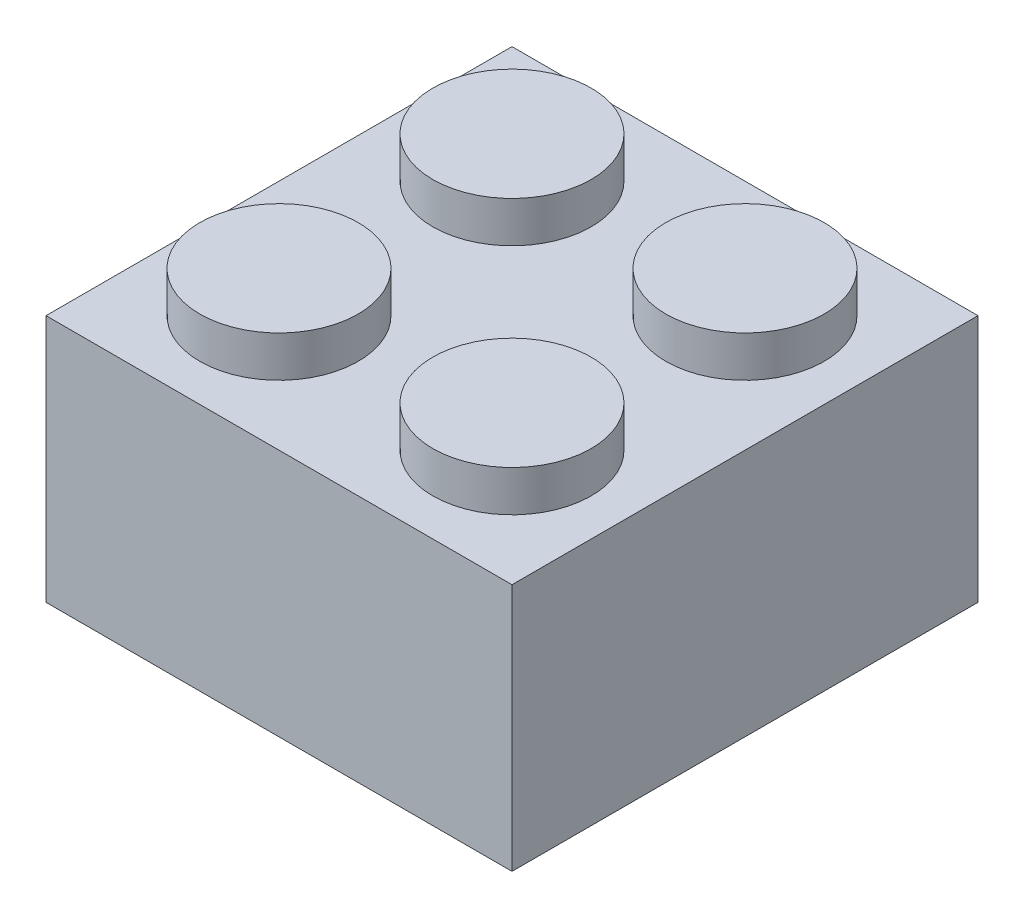
ISO-10303-21;
HEADER;
FILE_DESCRIPTION(('STEP AP214'),'2;1');
FILE_NAME('part.step','',(''),(''),'','','');
FILE_SCHEMA(('AUTOMOTIVE_DESIGN { 1 0 10303 214 1 1 1 1 }'));
ENDSEC;
DATA;
#1=APPLICATION_CONTEXT('core data for automotive mechanical design processes');
#2=APPLICATION_PROTOCOL_DEFINITION('international standard','automotive_design',2000,#1);
#3=PRODUCT_CONTEXT('',#1,'mechanical');
#4=PRODUCT('Part','Part','',(#3));
#5=PRODUCT_RELATED_PRODUCT_CATEGORY('part','',(#4));
#6=PRODUCT_DEFINITION_FORMATION('','',#4);
#7=PRODUCT_DEFINITION_CONTEXT('part definition',#1,'design');
#8=PRODUCT_DEFINITION('design','',#6,#7);
#9=PRODUCT_DEFINITION_SHAPE('','',#8);
#10=(LENGTH_UNIT() NAMED_UNIT(*) SI_UNIT(.MILLI.,.METRE.));
#11=(NAMED_UNIT(*) PLANE_ANGLE_UNIT() SI_UNIT($,.RADIAN.));
#12=(NAMED_UNIT(*) SI_UNIT($,.STERADIAN.) SOLID_ANGLE_UNIT());
#13=UNCERTAINTY_MEASURE_WITH_UNIT(LENGTH_MEASURE(1.E-05),#10,'distance_accuracy_value','');
#14=(GEOMETRIC_REPRESENTATION_CONTEXT(3) GLOBAL_UNCERTAINTY_ASSIGNED_CONTEXT((#13)) GLOBAL_UNIT_ASSIGNED_CONTEXT((#10,
#11,#12)) REPRESENTATION_CONTEXT('',''));
#15=CARTESIAN_POINT('',(0.,0.,0.));
#16=DIRECTION('',(0.,0.,1.));
#17=DIRECTION('',(1.,0.,0.));
#18=AXIS2_PLACEMENT_3D('',#15,#16,#17);
#19=CARTESIAN_POINT('',(7.93750000000001,4.2291,7.93749999999999));
#20=DIRECTION('',(0.,1.,0.));
#21=DIRECTION('',(0.,0.,1.));
#22=AXIS2_PLACEMENT_3D('',#19,#20,#21);
#23=PLANE('',#22);
#24=CARTESIAN_POINT('',(3.96875000000001,4.2291,3.96875));
#25=DIRECTION('',(0.,1.,0.));
#26=DIRECTION('',(0.,0.,1.));
#27=AXIS2_PLACEMENT_3D('',#24,#25,#26);
#28=CIRCLE('',#27,2.69875);
#29=CARTESIAN_POINT('',(3.96875000000001,4.2291,6.6675));
#30=VERTEX_POINT('',#29);
#31=EDGE_CURVE('E439',#30,#30,#28,.T.);
#32=ORIENTED_EDGE('',*,*,#31,.F.);
#33=EDGE_LOOP('',(#32));
#34=FACE_BOUND('',#33,.T.);
#35=DIRECTION('',(0.,0.,-1.));
#36=VECTOR('',#35,1.);
#37=CARTESIAN_POINT('',(7.9375,4.2291,-7.9375));
#38=LINE('',#37,#36);
#39=CARTESIAN_POINT('',(7.93750000000001,4.2291,7.93749999999999));
#40=VERTEX_POINT('',#39);
#41=CARTESIAN_POINT('',(7.9375,4.2291,-7.9375));
#42=VERTEX_POINT('',#41);
#43=EDGE_CURVE('E175',#40,#42,#38,.T.);
#44=ORIENTED_EDGE('',*,*,#43,.T.);
#45=DIRECTION('',(-1.,0.,0.));
#46=VECTOR('',#45,1.);
#47=CARTESIAN_POINT('',(-7.9375,4.2291,-7.9375));
#48=LINE('',#47,#46);
#49=CARTESIAN_POINT('',(-7.9375,4.2291,-7.9375));
#50=VERTEX_POINT('',#49);
#51=EDGE_CURVE('E115',#42,#50,#48,.T.);
#52=ORIENTED_EDGE('',*,*,#51,.T.);
#53=DIRECTION('',(0.,0.,1.));
#54=VECTOR('',#53,1.);
#55=CARTESIAN_POINT('',(-7.9375,4.2291,-7.9375));
#56=LINE('',#55,#54);
#57=CARTESIAN_POINT('',(-7.93749999999999,4.2291,7.9375));
#58=VERTEX_POINT('',#57);
#59=EDGE_CURVE('E179',#50,#58,#56,.T.);
#60=ORIENTED_EDGE('',*,*,#59,.T.);
#61=DIRECTION('',(1.,0.,0.));
#62=VECTOR('',#61,1.);
#63=CARTESIAN_POINT('',(-7.93749999999999,4.2291,7.9375));
#64=LINE('',#63,#62);
#65=EDGE_CURVE('E84',#58,#40,#64,.T.);
#66=ORIENTED_EDGE('',*,*,#65,.T.);
#67=EDGE_LOOP('',(#44,#52,#60,#66));
#68=FACE_BOUND('',#67,.T.);
#69=CARTESIAN_POINT('',(-3.96874999999999,4.2291,3.96875));
#70=DIRECTION('',(0.,1.,0.));
#71=DIRECTION('',(0.,0.,1.));
#72=AXIS2_PLACEMENT_3D('',#69,#70,#71);
#73=CIRCLE('',#72,2.69875);
#74=CARTESIAN_POINT('',(-3.96874999999999,4.2291,6.6675));
#75=VERTEX_POINT('',#74);
#76=EDGE_CURVE('E430',#75,#75,#73,.T.);
#77=ORIENTED_EDGE('',*,*,#76,.F.);
#78=EDGE_LOOP('',(#77));
#79=FACE_BOUND('',#78,.T.);
#80=CARTESIAN_POINT('',(3.96875,4.2291,-3.96875));
#81=DIRECTION('',(0.,1.,0.));
#82=DIRECTION('',(0.,0.,1.));
#83=AXIS2_PLACEMENT_3D('',#80,#81,#82);
#84=CIRCLE('',#83,2.69875);
#85=CARTESIAN_POINT('',(3.96875,4.2291,-1.27));
#86=VERTEX_POINT('',#85);
#87=EDGE_CURVE('E206',#86,#86,#84,.T.);
#88=ORIENTED_EDGE('',*,*,#87,.F.);
#89=EDGE_LOOP('',(#88));
#90=FACE_BOUND('',#89,.T.);
#91=CARTESIAN_POINT('',(-3.96875,4.2291,-3.96875));
#92=DIRECTION('',(0.,1.,0.));
#93=DIRECTION('',(0.,0.,1.));
#94=AXIS2_PLACEMENT_3D('',#91,#92,#93);
#95=CIRCLE('',#94,2.69875);
#96=CARTESIAN_POINT('',(-3.96875,4.2291,-1.27));
#97=VERTEX_POINT('',#96);
#98=EDGE_CURVE('E66',#97,#97,#95,.T.);
#99=ORIENTED_EDGE('',*,*,#98,.F.);
#100=EDGE_LOOP('',(#99));
#101=FACE_BOUND('',#100,.T.);
#102=ADVANCED_FACE('F57',(#34,#68,#79,#90,#101),#23,.T.);
#103=CARTESIAN_POINT('',(7.9375,4.2291,-7.9375));
#104=DIRECTION('',(-1.,0.,0.));
#105=DIRECTION('',(0.,0.,1.));
#106=AXIS2_PLACEMENT_3D('',#103,#104,#105);
#107=PLANE('',#106);
#108=DIRECTION('',(0.,0.,-1.));
#109=VECTOR('',#108,1.);
#110=CARTESIAN_POINT('',(7.9375,-4.2291,-7.9375));
#111=LINE('',#110,#109);
#112=CARTESIAN_POINT('',(7.93750000000001,-4.2291,7.93749999999999));
#113=VERTEX_POINT('',#112);
#114=CARTESIAN_POINT('',(7.9375,-4.2291,-7.9375));
#115=VERTEX_POINT('',#114);
#116=EDGE_CURVE('E184',#113,#115,#111,.T.);
#117=ORIENTED_EDGE('',*,*,#116,.T.);
#118=DIRECTION('',(0.,-1.,0.));
#119=VECTOR('',#118,1.);
#120=CARTESIAN_POINT('',(7.9375,4.2291,-7.9375));
#121=LINE('',#120,#119);
#122=EDGE_CURVE('E204',#42,#115,#121,.T.);
#123=ORIENTED_EDGE('',*,*,#122,.F.);
#124=ORIENTED_EDGE('',*,*,#43,.F.);
#125=DIRECTION('',(0.,-1.,0.));
#126=VECTOR('',#125,1.);
#127=CARTESIAN_POINT('',(7.93750000000001,4.2291,7.93749999999999));
#128=LINE('',#127,#126);
#129=EDGE_CURVE('E183',#40,#113,#128,.T.);
#130=ORIENTED_EDGE('',*,*,#129,.T.);
#131=EDGE_LOOP('',(#117,#123,#124,#130));
#132=FACE_BOUND('',#131,.T.);
#133=ADVANCED_FACE('F221',(#132),#107,.F.);
#134=CARTESIAN_POINT('',(-7.9375,4.2291,-7.9375));
#135=DIRECTION('',(0.,0.,1.));
#136=DIRECTION('',(1.,0.,0.));
#137=AXIS2_PLACEMENT_3D('',#134,#135,#136);
#138=PLANE('',#137);
#139=DIRECTION('',(-1.,0.,0.));
#140=VECTOR('',#139,1.);
#141=CARTESIAN_POINT('',(-7.9375,-4.2291,-7.9375));
#142=LINE('',#141,#140);
#143=CARTESIAN_POINT('',(-7.9375,-4.2291,-7.9375));
#144=VERTEX_POINT('',#143);
#145=EDGE_CURVE('E188',#115,#144,#142,.T.);
#146=ORIENTED_EDGE('',*,*,#145,.T.);
#147=DIRECTION('',(0.,-1.,0.));
#148=VECTOR('',#147,1.);
#149=CARTESIAN_POINT('',(-7.9375,4.2291,-7.9375));
#150=LINE('',#149,#148);
#151=EDGE_CURVE('E201',#50,#144,#150,.T.);
#152=ORIENTED_EDGE('',*,*,#151,.F.);
#153=ORIENTED_EDGE('',*,*,#51,.F.);
#154=ORIENTED_EDGE('',*,*,#122,.T.);
#155=EDGE_LOOP('',(#146,#152,#153,#154));
#156=FACE_BOUND('',#155,.T.);
#157=ADVANCED_FACE('F227',(#156),#138,.F.);
#158=CARTESIAN_POINT('',(-7.9375,4.2291,-7.9375));
#159=DIRECTION('',(1.,0.,0.));
#160=DIRECTION('',(0.,0.,-1.));
#161=AXIS2_PLACEMENT_3D('',#158,#159,#160);
#162=PLANE('',#161);
#163=DIRECTION('',(0.,0.,1.));
#164=VECTOR('',#163,1.);
#165=CARTESIAN_POINT('',(-7.9375,-4.2291,-7.9375));
#166=LINE('',#165,#164);
#167=CARTESIAN_POINT('',(-7.93749999999999,-4.2291,7.9375));
#168=VERTEX_POINT('',#167);
#169=EDGE_CURVE('E191',#144,#168,#166,.T.);
#170=ORIENTED_EDGE('',*,*,#169,.T.);
#171=DIRECTION('',(0.,-1.,0.));
#172=VECTOR('',#171,1.);
#173=CARTESIAN_POINT('',(-7.93749999999999,4.2291,7.9375));
#174=LINE('',#173,#172);
#175=EDGE_CURVE('E198',#58,#168,#174,.T.);
#176=ORIENTED_EDGE('',*,*,#175,.F.);
#177=ORIENTED_EDGE('',*,*,#59,.F.);
#178=ORIENTED_EDGE('',*,*,#151,.T.);
#179=EDGE_LOOP('',(#170,#176,#177,#178));
#180=FACE_BOUND('',#179,.T.);
#181=ADVANCED_FACE('F243',(#180),#162,.F.);
#182=CARTESIAN_POINT('',(-7.93749999999999,4.2291,7.9375));
#183=DIRECTION('',(0.,0.,-1.));
#184=DIRECTION('',(-1.,0.,0.));
#185=AXIS2_PLACEMENT_3D('',#182,#183,#184);
#186=PLANE('',#185);
#187=DIRECTION('',(1.,0.,0.));
#188=VECTOR('',#187,1.);
#189=CARTESIAN_POINT('',(-7.93749999999999,-4.2291,7.9375));
#190=LINE('',#189,#188);
#191=EDGE_CURVE('E107',#168,#113,#190,.T.);
#192=ORIENTED_EDGE('',*,*,#191,.T.);
#193=ORIENTED_EDGE('',*,*,#129,.F.);
#194=ORIENTED_EDGE('',*,*,#65,.F.);
#195=ORIENTED_EDGE('',*,*,#175,.T.);
#196=EDGE_LOOP('',(#192,#193,#194,#195));
#197=FACE_BOUND('',#196,.T.);
#198=ADVANCED_FACE('F238',(#197),#186,.F.);
#199=CARTESIAN_POINT('',(7.93750000000001,-4.2291,7.93749999999999));
#200=DIRECTION('',(0.,1.,0.));
#201=DIRECTION('',(0.,0.,1.));
#202=AXIS2_PLACEMENT_3D('',#199,#200,#201);
#203=PLANE('',#202);
#204=DIRECTION('',(0.,0.,1.));
#205=VECTOR('',#204,1.);
#206=CARTESIAN_POINT('',(6.6675,-4.2291,-17.6039213562373));
#207=LINE('',#206,#205);
#208=CARTESIAN_POINT('',(6.6675,-4.2291,-6.6675));
#209=VERTEX_POINT('',#208);
#210=CARTESIAN_POINT('',(6.66750000000001,-4.2291,6.66749999999999));
#211=VERTEX_POINT('',#210);
#212=EDGE_CURVE('E171',#209,#211,#207,.T.);
#213=ORIENTED_EDGE('',*,*,#212,.F.);
#214=DIRECTION('',(1.,0.,0.));
#215=VECTOR('',#214,1.);
#216=CARTESIAN_POINT('',(0.,-4.2291,-6.6675));
#217=LINE('',#216,#215);
#218=CARTESIAN_POINT('',(-6.6675,-4.2291,-6.6675));
#219=VERTEX_POINT('',#218);
#220=EDGE_CURVE('E409',#219,#209,#217,.T.);
#221=ORIENTED_EDGE('',*,*,#220,.F.);
#222=DIRECTION('',(0.,0.,-1.));
#223=VECTOR('',#222,1.);
#224=CARTESIAN_POINT('',(-6.6675,-4.2291,-17.6039213562373));
#225=LINE('',#224,#223);
#226=CARTESIAN_POINT('',(-6.66749999999999,-4.2291,6.6675));
#227=VERTEX_POINT('',#226);
#228=EDGE_CURVE('E162',#227,#219,#225,.T.);
#229=ORIENTED_EDGE('',*,*,#228,.F.);
#230=DIRECTION('',(-1.,0.,0.));
#231=VECTOR('',#230,1.);
#232=CARTESIAN_POINT('',(0.,-4.2291,6.6675));
#233=LINE('',#232,#231);
#234=EDGE_CURVE('E75',#211,#227,#233,.T.);
#235=ORIENTED_EDGE('',*,*,#234,.F.);
#236=EDGE_LOOP('',(#213,#221,#229,#235));
#237=FACE_BOUND('',#236,.T.);
#238=ORIENTED_EDGE('',*,*,#116,.F.);
#239=ORIENTED_EDGE('',*,*,#191,.F.);
#240=ORIENTED_EDGE('',*,*,#169,.F.);
#241=ORIENTED_EDGE('',*,*,#145,.F.);
#242=EDGE_LOOP('',(#238,#239,#240,#241));
#243=FACE_BOUND('',#242,.T.);
#244=ADVANCED_FACE('F235',(#237,#243),#203,.F.);
#245=CARTESIAN_POINT('',(0.,23.0876378542452,0.));
#246=DIRECTION('',(0.,-1.,0.));
#247=DIRECTION('',(0.,0.,-1.));
#248=AXIS2_PLACEMENT_3D('',#245,#246,#247);
#249=CYLINDRICAL_SURFACE('',#248,3.175);
#250=CARTESIAN_POINT('',(0.,-4.2291,0.));
#251=DIRECTION('',(0.,-1.,0.));
#252=DIRECTION('',(0.,0.,-1.));
#253=AXIS2_PLACEMENT_3D('',#250,#251,#252);
#254=CIRCLE('',#253,3.175);
#255=CARTESIAN_POINT('',(0.,-4.2291,-3.175));
#256=VERTEX_POINT('',#255);
#257=EDGE_CURVE('E158',#256,#256,#254,.T.);
#258=ORIENTED_EDGE('',*,*,#257,.F.);
#259=EDGE_LOOP('',(#258));
#260=FACE_BOUND('',#259,.T.);
#261=CARTESIAN_POINT('',(0.,2.9591,0.));
#262=DIRECTION('',(0.,1.,0.));
#263=DIRECTION('',(0.,0.,1.));
#264=AXIS2_PLACEMENT_3D('',#261,#262,#263);
#265=CIRCLE('',#264,3.175);
#266=CARTESIAN_POINT('',(0.,2.9591,3.175));
#267=VERTEX_POINT('',#266);
#268=EDGE_CURVE('E149',#267,#267,#265,.F.);
#269=ORIENTED_EDGE('',*,*,#268,.T.);
#270=EDGE_LOOP('',(#269));
#271=FACE_BOUND('',#270,.T.);
#272=ADVANCED_FACE('F233',(#260,#271),#249,.T.);
#273=CARTESIAN_POINT('',(0.,23.0876378542452,-6.6675));
#274=DIRECTION('',(0.,0.,-1.));
#275=DIRECTION('',(-1.,0.,0.));
#276=AXIS2_PLACEMENT_3D('',#273,#274,#275);
#277=PLANE('',#276);
#278=DIRECTION('',(0.,-1.,0.));
#279=VECTOR('',#278,1.);
#280=CARTESIAN_POINT('',(-6.6675,23.0876378542452,-6.6675));
#281=LINE('',#280,#279);
#282=CARTESIAN_POINT('',(-6.6675,2.9591,-6.6675));
#283=VERTEX_POINT('',#282);
#284=EDGE_CURVE('E143',#283,#219,#281,.T.);
#285=ORIENTED_EDGE('',*,*,#284,.T.);
#286=ORIENTED_EDGE('',*,*,#220,.T.);
#287=DIRECTION('',(0.,-1.,0.));
#288=VECTOR('',#287,1.);
#289=CARTESIAN_POINT('',(6.6675,23.0876378542452,-6.6675));
#290=LINE('',#289,#288);
#291=CARTESIAN_POINT('',(6.6675,2.9591,-6.6675));
#292=VERTEX_POINT('',#291);
#293=EDGE_CURVE('E145',#292,#209,#290,.T.);
#294=ORIENTED_EDGE('',*,*,#293,.F.);
#295=DIRECTION('',(1.,0.,0.));
#296=VECTOR('',#295,1.);
#297=CARTESIAN_POINT('',(0.,2.9591,-6.6675));
#298=LINE('',#297,#296);
#299=EDGE_CURVE('E138',#283,#292,#298,.T.);
#300=ORIENTED_EDGE('',*,*,#299,.F.);
#301=EDGE_LOOP('',(#285,#286,#294,#300));
#302=FACE_BOUND('',#301,.T.);
#303=ADVANCED_FACE('F140',(#302),#277,.F.);
#304=CARTESIAN_POINT('',(6.6675,23.0876378542452,-17.6039213562373));
#305=DIRECTION('',(1.,0.,0.));
#306=DIRECTION('',(0.,0.,-1.));
#307=AXIS2_PLACEMENT_3D('',#304,#305,#306);
#308=PLANE('',#307);
#309=ORIENTED_EDGE('',*,*,#293,.T.);
#310=ORIENTED_EDGE('',*,*,#212,.T.);
#311=DIRECTION('',(0.,-1.,0.));
#312=VECTOR('',#311,1.);
#313=CARTESIAN_POINT('',(6.66750000000001,23.0876378542452,6.66749999999999));
#314=LINE('',#313,#312);
#315=CARTESIAN_POINT('',(6.66750000000001,2.9591,6.66749999999999));
#316=VERTEX_POINT('',#315);
#317=EDGE_CURVE('E168',#316,#211,#314,.T.);
#318=ORIENTED_EDGE('',*,*,#317,.F.);
#319=DIRECTION('',(0.,0.,1.));
#320=VECTOR('',#319,1.);
#321=CARTESIAN_POINT('',(6.6675,2.9591,-17.6039213562373));
#322=LINE('',#321,#320);
#323=EDGE_CURVE('E454',#292,#316,#322,.T.);
#324=ORIENTED_EDGE('',*,*,#323,.F.);
#325=EDGE_LOOP('',(#309,#310,#318,#324));
#326=FACE_BOUND('',#325,.T.);
#327=ADVANCED_FACE('F349',(#326),#308,.F.);
#328=CARTESIAN_POINT('',(0.,23.0876378542452,6.6675));
#329=DIRECTION('',(0.,0.,1.));
#330=DIRECTION('',(1.,0.,0.));
#331=AXIS2_PLACEMENT_3D('',#328,#329,#330);
#332=PLANE('',#331);
#333=ORIENTED_EDGE('',*,*,#317,.T.);
#334=ORIENTED_EDGE('',*,*,#234,.T.);
#335=DIRECTION('',(0.,-1.,0.));
#336=VECTOR('',#335,1.);
#337=CARTESIAN_POINT('',(-6.66749999999999,23.0876378542452,6.6675));
#338=LINE('',#337,#336);
#339=CARTESIAN_POINT('',(-6.66749999999999,2.9591,6.6675));
#340=VERTEX_POINT('',#339);
#341=EDGE_CURVE('E150',#340,#227,#338,.T.);
#342=ORIENTED_EDGE('',*,*,#341,.F.);
#343=DIRECTION('',(-1.,0.,0.));
#344=VECTOR('',#343,1.);
#345=CARTESIAN_POINT('',(0.,2.9591,6.6675));
#346=LINE('',#345,#344);
#347=EDGE_CURVE('E156',#316,#340,#346,.T.);
#348=ORIENTED_EDGE('',*,*,#347,.F.);
#349=EDGE_LOOP('',(#333,#334,#342,#348));
#350=FACE_BOUND('',#349,.T.);
#351=ADVANCED_FACE('F344',(#350),#332,.F.);
#352=CARTESIAN_POINT('',(-6.6675,23.0876378542452,-17.6039213562373));
#353=DIRECTION('',(-1.,0.,0.));
#354=DIRECTION('',(0.,0.,1.));
#355=AXIS2_PLACEMENT_3D('',#352,#353,#354);
#356=PLANE('',#355);
#357=ORIENTED_EDGE('',*,*,#341,.T.);
#358=ORIENTED_EDGE('',*,*,#228,.T.);
#359=ORIENTED_EDGE('',*,*,#284,.F.);
#360=DIRECTION('',(0.,0.,-1.));
#361=VECTOR('',#360,1.);
#362=CARTESIAN_POINT('',(-6.6675,2.9591,-17.6039213562373));
#363=LINE('',#362,#361);
#364=EDGE_CURVE('E153',#340,#283,#363,.T.);
#365=ORIENTED_EDGE('',*,*,#364,.F.);
#366=EDGE_LOOP('',(#357,#358,#359,#365));
#367=FACE_BOUND('',#366,.T.);
#368=ADVANCED_FACE('F160',(#367),#356,.F.);
#369=CARTESIAN_POINT('',(7.93750000000001,2.9591,7.93749999999999));
#370=DIRECTION('',(0.,1.,0.));
#371=DIRECTION('',(0.,0.,1.));
#372=AXIS2_PLACEMENT_3D('',#369,#370,#371);
#373=PLANE('',#372);
#374=ORIENTED_EDGE('',*,*,#364,.T.);
#375=ORIENTED_EDGE('',*,*,#299,.T.);
#376=ORIENTED_EDGE('',*,*,#323,.T.);
#377=ORIENTED_EDGE('',*,*,#347,.T.);
#378=EDGE_LOOP('',(#374,#375,#376,#377));
#379=FACE_BOUND('',#378,.T.);
#380=ORIENTED_EDGE('',*,*,#268,.F.);
#381=EDGE_LOOP('',(#380));
#382=FACE_BOUND('',#381,.T.);
#383=ADVANCED_FACE('F154',(#379,#382),#373,.F.);
#384=CARTESIAN_POINT('',(0.,-4.2291,0.));
#385=DIRECTION('',(0.,-1.,0.));
#386=DIRECTION('',(0.,0.,-1.));
#387=AXIS2_PLACEMENT_3D('',#384,#385,#386);
#388=CIRCLE('',#387,2.413);
#389=CARTESIAN_POINT('',(0.,-4.2291,-2.413));
#390=VERTEX_POINT('',#389);
#391=EDGE_CURVE('E445',#390,#390,#388,.T.);
#392=ORIENTED_EDGE('',*,*,#391,.F.);
#393=EDGE_LOOP('',(#392));
#394=FACE_BOUND('',#393,.T.);
#395=ORIENTED_EDGE('',*,*,#257,.T.);
#396=EDGE_LOOP('',(#395));
#397=FACE_BOUND('',#396,.T.);
#398=ADVANCED_FACE('F240',(#394,#397),#203,.F.);
#399=CARTESIAN_POINT('',(7.93750000000001,2.9591,7.93749999999999));
#400=DIRECTION('',(0.,1.,0.));
#401=DIRECTION('',(0.,0.,1.));
#402=AXIS2_PLACEMENT_3D('',#399,#400,#401);
#403=PLANE('',#402);
#404=CARTESIAN_POINT('',(0.,2.9591,0.));
#405=DIRECTION('',(0.,1.,0.));
#406=DIRECTION('',(0.,0.,1.));
#407=AXIS2_PLACEMENT_3D('',#404,#405,#406);
#408=CIRCLE('',#407,2.413);
#409=CARTESIAN_POINT('',(0.,2.9591,2.413));
#410=VERTEX_POINT('',#409);
#411=EDGE_CURVE('E451',#410,#410,#408,.F.);
#412=ORIENTED_EDGE('',*,*,#411,.T.);
#413=EDGE_LOOP('',(#412));
#414=FACE_BOUND('',#413,.T.);
#415=ADVANCED_FACE('F315',(#414),#403,.F.);
#416=CARTESIAN_POINT('',(0.,23.0876378542452,0.));
#417=DIRECTION('',(0.,-1.,0.));
#418=DIRECTION('',(0.,0.,-1.));
#419=AXIS2_PLACEMENT_3D('',#416,#417,#418);
#420=CYLINDRICAL_SURFACE('',#419,2.413);
#421=ORIENTED_EDGE('',*,*,#391,.T.);
#422=EDGE_LOOP('',(#421));
#423=FACE_BOUND('',#422,.T.);
#424=ORIENTED_EDGE('',*,*,#411,.F.);
#425=EDGE_LOOP('',(#424));
#426=FACE_BOUND('',#425,.T.);
#427=ADVANCED_FACE('F306',(#423,#426),#420,.F.);
#428=CARTESIAN_POINT('',(3.96875000000001,5.6261,3.96875));
#429=DIRECTION('',(0.,-1.,0.));
#430=DIRECTION('',(0.,0.,-1.));
#431=AXIS2_PLACEMENT_3D('',#428,#429,#430);
#432=CYLINDRICAL_SURFACE('',#431,2.69875);
#433=CARTESIAN_POINT('',(3.96875000000001,5.6261,3.96875));
#434=DIRECTION('',(0.,1.,0.));
#435=DIRECTION('',(0.,0.,1.));
#436=AXIS2_PLACEMENT_3D('',#433,#434,#435);
#437=CIRCLE('',#436,2.69875);
#438=CARTESIAN_POINT('',(3.96875000000001,5.6261,6.6675));
#439=VERTEX_POINT('',#438);
#440=EDGE_CURVE('E442',#439,#439,#437,.T.);
#441=ORIENTED_EDGE('',*,*,#440,.F.);
#442=EDGE_LOOP('',(#441));
#443=FACE_BOUND('',#442,.T.);
#444=ORIENTED_EDGE('',*,*,#31,.T.);
#445=EDGE_LOOP('',(#444));
#446=FACE_BOUND('',#445,.T.);
#447=ADVANCED_FACE('F297',(#443,#446),#432,.T.);
#448=CARTESIAN_POINT('',(3.96875000000001,5.6261,3.96875));
#449=DIRECTION('',(0.,1.,0.));
#450=DIRECTION('',(0.,0.,1.));
#451=AXIS2_PLACEMENT_3D('',#448,#449,#450);
#452=PLANE('',#451);
#453=ORIENTED_EDGE('',*,*,#440,.T.);
#454=EDGE_LOOP('',(#453));
#455=FACE_BOUND('',#454,.T.);
#456=ADVANCED_FACE('F289',(#455),#452,.T.);
#457=CARTESIAN_POINT('',(-3.96874999999999,5.6261,3.96875));
#458=DIRECTION('',(0.,-1.,0.));
#459=DIRECTION('',(0.,0.,-1.));
#460=AXIS2_PLACEMENT_3D('',#457,#458,#459);
#461=CYLINDRICAL_SURFACE('',#460,2.69875);
#462=CARTESIAN_POINT('',(-3.96874999999999,5.6261,3.96875));
#463=DIRECTION('',(0.,1.,0.));
#464=DIRECTION('',(0.,0.,1.));
#465=AXIS2_PLACEMENT_3D('',#462,#463,#464);
#466=CIRCLE('',#465,2.69875);
#467=CARTESIAN_POINT('',(-3.96874999999999,5.6261,6.6675));
#468=VERTEX_POINT('',#467);
#469=EDGE_CURVE('E435',#468,#468,#466,.T.);
#470=ORIENTED_EDGE('',*,*,#469,.F.);
#471=EDGE_LOOP('',(#470));
#472=FACE_BOUND('',#471,.T.);
#473=ORIENTED_EDGE('',*,*,#76,.T.);
#474=EDGE_LOOP('',(#473));
#475=FACE_BOUND('',#474,.T.);
#476=ADVANCED_FACE('F280',(#472,#475),#461,.T.);
#477=CARTESIAN_POINT('',(-3.96874999999999,5.6261,3.96875));
#478=DIRECTION('',(0.,1.,0.));
#479=DIRECTION('',(0.,0.,1.));
#480=AXIS2_PLACEMENT_3D('',#477,#478,#479);
#481=PLANE('',#480);
#482=ORIENTED_EDGE('',*,*,#469,.T.);
#483=EDGE_LOOP('',(#482));
#484=FACE_BOUND('',#483,.T.);
#485=ADVANCED_FACE('F255',(#484),#481,.T.);
#486=CARTESIAN_POINT('',(3.96875,5.6261,-3.96875));
#487=DIRECTION('',(0.,1.,0.));
#488=DIRECTION('',(0.,0.,1.));
#489=AXIS2_PLACEMENT_3D('',#486,#487,#488);
#490=PLANE('',#489);
#491=CARTESIAN_POINT('',(3.96875,5.6261,-3.96875));
#492=DIRECTION('',(0.,1.,0.));
#493=DIRECTION('',(0.,0.,1.));
#494=AXIS2_PLACEMENT_3D('',#491,#492,#493);
#495=CIRCLE('',#494,2.69875);
#496=CARTESIAN_POINT('',(3.96875,5.6261,-1.27));
#497=VERTEX_POINT('',#496);
#498=EDGE_CURVE('E210',#497,#497,#495,.T.);
#499=ORIENTED_EDGE('',*,*,#498,.T.);
#500=EDGE_LOOP('',(#499));
#501=FACE_BOUND('',#500,.T.);
#502=ADVANCED_FACE('F252',(#501),#490,.T.);
#503=CARTESIAN_POINT('',(3.96875,5.6261,-3.96875));
#504=DIRECTION('',(0.,-1.,0.));
#505=DIRECTION('',(0.,0.,-1.));
#506=AXIS2_PLACEMENT_3D('',#503,#504,#505);
#507=CYLINDRICAL_SURFACE('',#506,2.69875);
#508=ORIENTED_EDGE('',*,*,#498,.F.);
#509=EDGE_LOOP('',(#508));
#510=FACE_BOUND('',#509,.T.);
#511=ORIENTED_EDGE('',*,*,#87,.T.);
#512=EDGE_LOOP('',(#511));
#513=FACE_BOUND('',#512,.T.);
#514=ADVANCED_FACE('F249',(#510,#513),#507,.T.);
#515=CARTESIAN_POINT('',(-3.96875,5.6261,-3.96875));
#516=DIRECTION('',(0.,1.,0.));
#517=DIRECTION('',(0.,0.,1.));
#518=AXIS2_PLACEMENT_3D('',#515,#516,#517);
#519=PLANE('',#518);
#520=CARTESIAN_POINT('',(-3.96875,5.6261,-3.96875));
#521=DIRECTION('',(0.,1.,0.));
#522=DIRECTION('',(0.,0.,1.));
#523=AXIS2_PLACEMENT_3D('',#520,#521,#522);
#524=CIRCLE('',#523,2.69875);
#525=CARTESIAN_POINT('',(-3.96875,5.6261,-1.27));
#526=VERTEX_POINT('',#525);
#527=EDGE_CURVE('E13',#526,#526,#524,.T.);
#528=ORIENTED_EDGE('',*,*,#527,.T.);
#529=EDGE_LOOP('',(#528));
#530=FACE_BOUND('',#529,.T.);
#531=ADVANCED_FACE('F59',(#530),#519,.T.);
#532=CARTESIAN_POINT('',(-3.96875,5.6261,-3.96875));
#533=DIRECTION('',(0.,-1.,0.));
#534=DIRECTION('',(0.,0.,-1.));
#535=AXIS2_PLACEMENT_3D('',#532,#533,#534);
#536=CYLINDRICAL_SURFACE('',#535,2.69875);
#537=ORIENTED_EDGE('',*,*,#527,.F.);
#538=EDGE_LOOP('',(#537));
#539=FACE_BOUND('',#538,.T.);
#540=ORIENTED_EDGE('',*,*,#98,.T.);
#541=EDGE_LOOP('',(#540));
#542=FACE_BOUND('',#541,.T.);
#543=ADVANCED_FACE('F218',(#539,#542),#536,.T.);
#544=CLOSED_SHELL('',(#102,#133,#157,#181,#198,#244,#272,#303,#327,#351,#368,#383,#398,#415,
#427,#447,#456,#476,#485,#502,#514,#531,#543));
#545=MANIFOLD_SOLID_BREP('B2',#544);
#546=ADVANCED_BREP_SHAPE_REPRESENTATION('',(#18,#545),#14);
#547=SHAPE_DEFINITION_REPRESENTATION(#9,#546);
ENDSEC;
END-ISO-10303-21;
